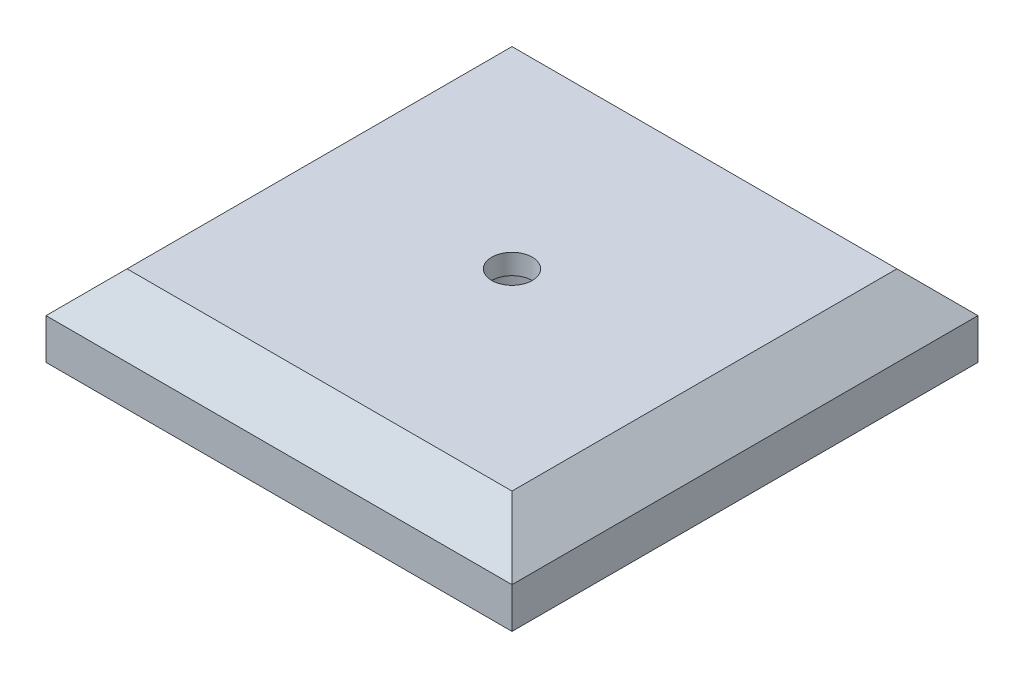
ISO-10303-21;
HEADER;
FILE_DESCRIPTION(('STEP AP214'),'2;1');
FILE_NAME('part.step','',(''),(''),'','','');
FILE_SCHEMA(('AUTOMOTIVE_DESIGN { 1 0 10303 214 1 1 1 1 }'));
ENDSEC;
DATA;
#1=APPLICATION_CONTEXT('core data for automotive mechanical design processes');
#2=APPLICATION_PROTOCOL_DEFINITION('international standard','automotive_design',2000,#1);
#3=PRODUCT_CONTEXT('',#1,'mechanical');
#4=PRODUCT('Part','Part','',(#3));
#5=PRODUCT_RELATED_PRODUCT_CATEGORY('part','',(#4));
#6=PRODUCT_DEFINITION_FORMATION('','',#4);
#7=PRODUCT_DEFINITION_CONTEXT('part definition',#1,'design');
#8=PRODUCT_DEFINITION('design','',#6,#7);
#9=PRODUCT_DEFINITION_SHAPE('','',#8);
#10=(LENGTH_UNIT() NAMED_UNIT(*) SI_UNIT(.MILLI.,.METRE.));
#11=(NAMED_UNIT(*) PLANE_ANGLE_UNIT() SI_UNIT($,.RADIAN.));
#12=(NAMED_UNIT(*) SI_UNIT($,.STERADIAN.) SOLID_ANGLE_UNIT());
#13=UNCERTAINTY_MEASURE_WITH_UNIT(LENGTH_MEASURE(1.E-05),#10,'distance_accuracy_value','');
#14=(GEOMETRIC_REPRESENTATION_CONTEXT(3) GLOBAL_UNCERTAINTY_ASSIGNED_CONTEXT((#13)) GLOBAL_UNIT_ASSIGNED_CONTEXT((#10,
#11,#12)) REPRESENTATION_CONTEXT('',''));
#15=CARTESIAN_POINT('',(0.,0.,0.));
#16=DIRECTION('',(0.,0.,1.));
#17=DIRECTION('',(1.,0.,0.));
#18=AXIS2_PLACEMENT_3D('',#15,#16,#17);
#19=CARTESIAN_POINT('',(36.5125,12.7,36.5125));
#20=DIRECTION('',(-1.,0.,0.));
#21=DIRECTION('',(0.,0.,1.));
#22=AXIS2_PLACEMENT_3D('',#19,#20,#21);
#23=PLANE('',#22);
#24=DIRECTION('',(0.,-1.,0.));
#25=VECTOR('',#24,1.);
#26=CARTESIAN_POINT('',(36.5125,12.7,-36.5125));
#27=LINE('',#26,#25);
#28=CARTESIAN_POINT('',(36.5125,6.34999999999996,-36.5125));
#29=VERTEX_POINT('',#28);
#30=CARTESIAN_POINT('',(36.5125,0.,-36.5125));
#31=VERTEX_POINT('',#30);
#32=EDGE_CURVE('E93',#29,#31,#27,.T.);
#33=ORIENTED_EDGE('',*,*,#32,.F.);
#34=DIRECTION('',(0.,0.,1.));
#35=VECTOR('',#34,1.);
#36=CARTESIAN_POINT('',(36.5125,6.34999999999996,36.5125));
#37=LINE('',#36,#35);
#38=CARTESIAN_POINT('',(36.5125,6.34999999999996,36.5125));
#39=VERTEX_POINT('',#38);
#40=EDGE_CURVE('E50',#29,#39,#37,.T.);
#41=ORIENTED_EDGE('',*,*,#40,.T.);
#42=DIRECTION('',(0.,-1.,0.));
#43=VECTOR('',#42,1.);
#44=CARTESIAN_POINT('',(36.5125,12.7,36.5125));
#45=LINE('',#44,#43);
#46=CARTESIAN_POINT('',(36.5125,0.,36.5125));
#47=VERTEX_POINT('',#46);
#48=EDGE_CURVE('E110',#39,#47,#45,.T.);
#49=ORIENTED_EDGE('',*,*,#48,.T.);
#50=DIRECTION('',(0.,0.,-1.));
#51=VECTOR('',#50,1.);
#52=CARTESIAN_POINT('',(36.5125,0.,36.5125));
#53=LINE('',#52,#51);
#54=EDGE_CURVE('E106',#47,#31,#53,.T.);
#55=ORIENTED_EDGE('',*,*,#54,.T.);
#56=EDGE_LOOP('',(#33,#41,#49,#55));
#57=FACE_BOUND('',#56,.T.);
#58=ADVANCED_FACE('F41',(#57),#23,.F.);
#59=CARTESIAN_POINT('',(-36.5125,12.7,-36.5125));
#60=DIRECTION('',(0.,0.,1.));
#61=DIRECTION('',(1.,0.,0.));
#62=AXIS2_PLACEMENT_3D('',#59,#60,#61);
#63=PLANE('',#62);
#64=DIRECTION('',(0.,-1.,0.));
#65=VECTOR('',#64,1.);
#66=CARTESIAN_POINT('',(-36.5125,12.7,-36.5125));
#67=LINE('',#66,#65);
#68=CARTESIAN_POINT('',(-36.5125,6.34999999999996,-36.5125));
#69=VERTEX_POINT('',#68);
#70=CARTESIAN_POINT('',(-36.5125,0.,-36.5125));
#71=VERTEX_POINT('',#70);
#72=EDGE_CURVE('E100',#69,#71,#67,.T.);
#73=ORIENTED_EDGE('',*,*,#72,.F.);
#74=DIRECTION('',(1.,0.,0.));
#75=VECTOR('',#74,1.);
#76=CARTESIAN_POINT('',(-36.5125,6.34999999999996,-36.5125));
#77=LINE('',#76,#75);
#78=EDGE_CURVE('E65',#69,#29,#77,.T.);
#79=ORIENTED_EDGE('',*,*,#78,.T.);
#80=ORIENTED_EDGE('',*,*,#32,.T.);
#81=DIRECTION('',(-1.,0.,0.));
#82=VECTOR('',#81,1.);
#83=CARTESIAN_POINT('',(-36.5125,0.,-36.5125));
#84=LINE('',#83,#82);
#85=EDGE_CURVE('E96',#31,#71,#84,.T.);
#86=ORIENTED_EDGE('',*,*,#85,.T.);
#87=EDGE_LOOP('',(#73,#79,#80,#86));
#88=FACE_BOUND('',#87,.T.);
#89=ADVANCED_FACE('F95',(#88),#63,.F.);
#90=CARTESIAN_POINT('',(-36.5125,12.7,36.5125));
#91=DIRECTION('',(1.,0.,0.));
#92=DIRECTION('',(0.,0.,-1.));
#93=AXIS2_PLACEMENT_3D('',#90,#91,#92);
#94=PLANE('',#93);
#95=DIRECTION('',(0.,-1.,0.));
#96=VECTOR('',#95,1.);
#97=CARTESIAN_POINT('',(-36.5125,12.7,36.5125));
#98=LINE('',#97,#96);
#99=CARTESIAN_POINT('',(-36.5125,6.34999999999996,36.5125));
#100=VERTEX_POINT('',#99);
#101=CARTESIAN_POINT('',(-36.5125,0.,36.5125));
#102=VERTEX_POINT('',#101);
#103=EDGE_CURVE('E123',#100,#102,#98,.T.);
#104=ORIENTED_EDGE('',*,*,#103,.F.);
#105=DIRECTION('',(0.,0.,-1.));
#106=VECTOR('',#105,1.);
#107=CARTESIAN_POINT('',(-36.5125,6.34999999999996,36.5125));
#108=LINE('',#107,#106);
#109=EDGE_CURVE('E134',#100,#69,#108,.T.);
#110=ORIENTED_EDGE('',*,*,#109,.T.);
#111=ORIENTED_EDGE('',*,*,#72,.T.);
#112=DIRECTION('',(0.,0.,1.));
#113=VECTOR('',#112,1.);
#114=CARTESIAN_POINT('',(-36.5125,0.,36.5125));
#115=LINE('',#114,#113);
#116=EDGE_CURVE('E108',#71,#102,#115,.T.);
#117=ORIENTED_EDGE('',*,*,#116,.T.);
#118=EDGE_LOOP('',(#104,#110,#111,#117));
#119=FACE_BOUND('',#118,.T.);
#120=ADVANCED_FACE('F162',(#119),#94,.F.);
#121=CARTESIAN_POINT('',(-36.5125,12.7,36.5125));
#122=DIRECTION('',(0.,0.,-1.));
#123=DIRECTION('',(-1.,0.,0.));
#124=AXIS2_PLACEMENT_3D('',#121,#122,#123);
#125=PLANE('',#124);
#126=ORIENTED_EDGE('',*,*,#48,.F.);
#127=DIRECTION('',(-1.,0.,0.));
#128=VECTOR('',#127,1.);
#129=CARTESIAN_POINT('',(-36.5125,6.34999999999996,36.5125));
#130=LINE('',#129,#128);
#131=EDGE_CURVE('E11',#39,#100,#130,.T.);
#132=ORIENTED_EDGE('',*,*,#131,.T.);
#133=ORIENTED_EDGE('',*,*,#103,.T.);
#134=DIRECTION('',(1.,0.,0.));
#135=VECTOR('',#134,1.);
#136=CARTESIAN_POINT('',(-36.5125,0.,36.5125));
#137=LINE('',#136,#135);
#138=EDGE_CURVE('E120',#102,#47,#137,.T.);
#139=ORIENTED_EDGE('',*,*,#138,.T.);
#140=EDGE_LOOP('',(#126,#132,#133,#139));
#141=FACE_BOUND('',#140,.T.);
#142=ADVANCED_FACE('F164',(#141),#125,.F.);
#143=CARTESIAN_POINT('',(0.,12.7,0.));
#144=DIRECTION('',(0.,-1.,0.));
#145=DIRECTION('',(0.,0.,-1.));
#146=AXIS2_PLACEMENT_3D('',#143,#144,#145);
#147=PLANE('',#146);
#148=CARTESIAN_POINT('',(0.,12.7,0.));
#149=DIRECTION('',(0.,1.,0.));
#150=DIRECTION('',(0.,0.,1.));
#151=AXIS2_PLACEMENT_3D('',#148,#149,#150);
#152=CIRCLE('',#151,3.175);
#153=CARTESIAN_POINT('',(0.,12.7,3.175));
#154=VERTEX_POINT('',#153);
#155=EDGE_CURVE('E116',#154,#154,#152,.T.);
#156=ORIENTED_EDGE('',*,*,#155,.F.);
#157=EDGE_LOOP('',(#156));
#158=FACE_BOUND('',#157,.T.);
#159=DIRECTION('',(-1.,0.,0.));
#160=VECTOR('',#159,1.);
#161=CARTESIAN_POINT('',(0.,12.7,-30.1625));
#162=LINE('',#161,#160);
#163=CARTESIAN_POINT('',(30.1625,12.7,-30.1625));
#164=VERTEX_POINT('',#163);
#165=CARTESIAN_POINT('',(-30.1625,12.7,-30.1625));
#166=VERTEX_POINT('',#165);
#167=EDGE_CURVE('E129',#164,#166,#162,.T.);
#168=ORIENTED_EDGE('',*,*,#167,.T.);
#169=DIRECTION('',(0.,0.,1.));
#170=VECTOR('',#169,1.);
#171=CARTESIAN_POINT('',(-30.1625,12.7,0.));
#172=LINE('',#171,#170);
#173=CARTESIAN_POINT('',(-30.1625,12.7,30.1625));
#174=VERTEX_POINT('',#173);
#175=EDGE_CURVE('E131',#166,#174,#172,.T.);
#176=ORIENTED_EDGE('',*,*,#175,.T.);
#177=DIRECTION('',(1.,0.,0.));
#178=VECTOR('',#177,1.);
#179=CARTESIAN_POINT('',(0.,12.7,30.1625));
#180=LINE('',#179,#178);
#181=CARTESIAN_POINT('',(30.1625,12.7,30.1625));
#182=VERTEX_POINT('',#181);
#183=EDGE_CURVE('E99',#174,#182,#180,.T.);
#184=ORIENTED_EDGE('',*,*,#183,.T.);
#185=DIRECTION('',(0.,0.,-1.));
#186=VECTOR('',#185,1.);
#187=CARTESIAN_POINT('',(30.1625,12.7,0.));
#188=LINE('',#187,#186);
#189=EDGE_CURVE('E127',#182,#164,#188,.T.);
#190=ORIENTED_EDGE('',*,*,#189,.T.);
#191=EDGE_LOOP('',(#168,#176,#184,#190));
#192=FACE_BOUND('',#191,.T.);
#193=ADVANCED_FACE('F154',(#158,#192),#147,.F.);
#194=CARTESIAN_POINT('',(0.,0.,0.));
#195=DIRECTION('',(0.,-1.,0.));
#196=DIRECTION('',(0.,0.,-1.));
#197=AXIS2_PLACEMENT_3D('',#194,#195,#196);
#198=PLANE('',#197);
#199=CARTESIAN_POINT('',(0.,0.,0.));
#200=DIRECTION('',(0.,-1.,0.));
#201=DIRECTION('',(0.,0.,-1.));
#202=AXIS2_PLACEMENT_3D('',#199,#200,#201);
#203=CIRCLE('',#202,6.35);
#204=CARTESIAN_POINT('',(0.,0.,-6.35));
#205=VERTEX_POINT('',#204);
#206=EDGE_CURVE('E213',#205,#205,#203,.T.);
#207=ORIENTED_EDGE('',*,*,#206,.F.);
#208=EDGE_LOOP('',(#207));
#209=FACE_BOUND('',#208,.T.);
#210=ORIENTED_EDGE('',*,*,#54,.F.);
#211=ORIENTED_EDGE('',*,*,#138,.F.);
#212=ORIENTED_EDGE('',*,*,#116,.F.);
#213=ORIENTED_EDGE('',*,*,#85,.F.);
#214=EDGE_LOOP('',(#210,#211,#212,#213));
#215=FACE_BOUND('',#214,.T.);
#216=ADVANCED_FACE('F104',(#209,#215),#198,.T.);
#217=CARTESIAN_POINT('',(30.1625,12.7,0.));
#218=DIRECTION('',(-0.707106781186549,-0.707106781186546,0.));
#219=DIRECTION('',(0.,0.,-1.));
#220=AXIS2_PLACEMENT_3D('',#217,#218,#219);
#221=PLANE('',#220);
#222=DIRECTION('',(-0.577350269189625,0.577350269189627,-0.577350269189625));
#223=VECTOR('',#222,1.);
#224=CARTESIAN_POINT('',(20.1083333333334,22.7541666666667,20.1083333333333));
#225=LINE('',#224,#223);
#226=EDGE_CURVE('E114',#39,#182,#225,.T.);
#227=ORIENTED_EDGE('',*,*,#226,.F.);
#228=ORIENTED_EDGE('',*,*,#40,.F.);
#229=DIRECTION('',(-0.577350269189625,0.577350269189627,0.577350269189625));
#230=VECTOR('',#229,1.);
#231=CARTESIAN_POINT('',(20.1083333333334,22.7541666666667,-20.1083333333334));
#232=LINE('',#231,#230);
#233=EDGE_CURVE('E45',#164,#29,#232,.F.);
#234=ORIENTED_EDGE('',*,*,#233,.F.);
#235=ORIENTED_EDGE('',*,*,#189,.F.);
#236=EDGE_LOOP('',(#227,#228,#234,#235));
#237=FACE_BOUND('',#236,.T.);
#238=ADVANCED_FACE('F43',(#237),#221,.F.);
#239=CARTESIAN_POINT('',(0.,12.7,-30.1625));
#240=DIRECTION('',(0.,-0.707106781186546,0.707106781186549));
#241=DIRECTION('',(-1.,0.,0.));
#242=AXIS2_PLACEMENT_3D('',#239,#240,#241);
#243=PLANE('',#242);
#244=ORIENTED_EDGE('',*,*,#233,.T.);
#245=ORIENTED_EDGE('',*,*,#78,.F.);
#246=DIRECTION('',(0.577350269189625,0.577350269189627,0.577350269189625));
#247=VECTOR('',#246,1.);
#248=CARTESIAN_POINT('',(-20.1083333333333,22.7541666666667,-20.1083333333334));
#249=LINE('',#248,#247);
#250=EDGE_CURVE('E141',#166,#69,#249,.F.);
#251=ORIENTED_EDGE('',*,*,#250,.F.);
#252=ORIENTED_EDGE('',*,*,#167,.F.);
#253=EDGE_LOOP('',(#244,#245,#251,#252));
#254=FACE_BOUND('',#253,.T.);
#255=ADVANCED_FACE('F185',(#254),#243,.F.);
#256=CARTESIAN_POINT('',(0.,12.7,30.1625));
#257=DIRECTION('',(0.,-0.707106781186546,-0.707106781186549));
#258=DIRECTION('',(1.,0.,0.));
#259=AXIS2_PLACEMENT_3D('',#256,#257,#258);
#260=PLANE('',#259);
#261=ORIENTED_EDGE('',*,*,#226,.T.);
#262=ORIENTED_EDGE('',*,*,#183,.F.);
#263=DIRECTION('',(-0.577350269189625,-0.577350269189627,0.577350269189625));
#264=VECTOR('',#263,1.);
#265=CARTESIAN_POINT('',(-20.1083333333333,22.7541666666667,20.1083333333334));
#266=LINE('',#265,#264);
#267=EDGE_CURVE('E139',#100,#174,#266,.F.);
#268=ORIENTED_EDGE('',*,*,#267,.F.);
#269=ORIENTED_EDGE('',*,*,#131,.F.);
#270=EDGE_LOOP('',(#261,#262,#268,#269));
#271=FACE_BOUND('',#270,.T.);
#272=ADVANCED_FACE('F147',(#271),#260,.F.);
#273=CARTESIAN_POINT('',(-30.1625,12.7,0.));
#274=DIRECTION('',(0.707106781186549,-0.707106781186546,0.));
#275=DIRECTION('',(0.,0.,1.));
#276=AXIS2_PLACEMENT_3D('',#273,#274,#275);
#277=PLANE('',#276);
#278=ORIENTED_EDGE('',*,*,#250,.T.);
#279=ORIENTED_EDGE('',*,*,#109,.F.);
#280=ORIENTED_EDGE('',*,*,#267,.T.);
#281=ORIENTED_EDGE('',*,*,#175,.F.);
#282=EDGE_LOOP('',(#278,#279,#280,#281));
#283=FACE_BOUND('',#282,.T.);
#284=ADVANCED_FACE('F158',(#283),#277,.F.);
#285=CARTESIAN_POINT('',(0.,9.525,0.));
#286=DIRECTION('',(0.,1.,0.));
#287=DIRECTION('',(0.,0.,1.));
#288=AXIS2_PLACEMENT_3D('',#285,#286,#287);
#289=CYLINDRICAL_SURFACE('',#288,3.175);
#290=CARTESIAN_POINT('',(0.,9.525,0.));
#291=DIRECTION('',(0.,1.,0.));
#292=DIRECTION('',(0.,0.,1.));
#293=AXIS2_PLACEMENT_3D('',#290,#291,#292);
#294=CIRCLE('',#293,3.175);
#295=CARTESIAN_POINT('',(0.,9.525,3.175));
#296=VERTEX_POINT('',#295);
#297=EDGE_CURVE('E218',#296,#296,#294,.T.);
#298=ORIENTED_EDGE('',*,*,#297,.F.);
#299=EDGE_LOOP('',(#298));
#300=FACE_BOUND('',#299,.T.);
#301=ORIENTED_EDGE('',*,*,#155,.T.);
#302=EDGE_LOOP('',(#301));
#303=FACE_BOUND('',#302,.T.);
#304=ADVANCED_FACE('F183',(#300,#303),#289,.F.);
#305=CARTESIAN_POINT('',(0.,9.525,0.));
#306=DIRECTION('',(0.,1.,0.));
#307=DIRECTION('',(0.,0.,1.));
#308=AXIS2_PLACEMENT_3D('',#305,#306,#307);
#309=PLANE('',#308);
#310=ORIENTED_EDGE('',*,*,#297,.T.);
#311=EDGE_LOOP('',(#310));
#312=FACE_BOUND('',#311,.T.);
#313=CARTESIAN_POINT('',(0.,9.525,0.));
#314=DIRECTION('',(0.,1.,0.));
#315=DIRECTION('',(0.,0.,1.));
#316=AXIS2_PLACEMENT_3D('',#313,#314,#315);
#317=CIRCLE('',#316,6.35);
#318=CARTESIAN_POINT('',(0.,9.525,6.35));
#319=VERTEX_POINT('',#318);
#320=EDGE_CURVE('E216',#319,#319,#317,.F.);
#321=ORIENTED_EDGE('',*,*,#320,.T.);
#322=EDGE_LOOP('',(#321));
#323=FACE_BOUND('',#322,.T.);
#324=ADVANCED_FACE('F201',(#312,#323),#309,.F.);
#325=CARTESIAN_POINT('',(0.,27.4855122421383,0.));
#326=DIRECTION('',(0.,-1.,0.));
#327=DIRECTION('',(0.,0.,-1.));
#328=AXIS2_PLACEMENT_3D('',#325,#326,#327);
#329=CYLINDRICAL_SURFACE('',#328,6.35);
#330=ORIENTED_EDGE('',*,*,#206,.T.);
#331=EDGE_LOOP('',(#330));
#332=FACE_BOUND('',#331,.T.);
#333=ORIENTED_EDGE('',*,*,#320,.F.);
#334=EDGE_LOOP('',(#333));
#335=FACE_BOUND('',#334,.T.);
#336=ADVANCED_FACE('F205',(#332,#335),#329,.F.);
#337=CLOSED_SHELL('',(#58,#89,#120,#142,#193,#216,#238,#255,#272,#284,#304,#324,#336));
#338=MANIFOLD_SOLID_BREP('B2',#337);
#339=ADVANCED_BREP_SHAPE_REPRESENTATION('',(#18,#338),#14);
#340=SHAPE_DEFINITION_REPRESENTATION(#9,#339);
ENDSEC;
END-ISO-10303-21;
